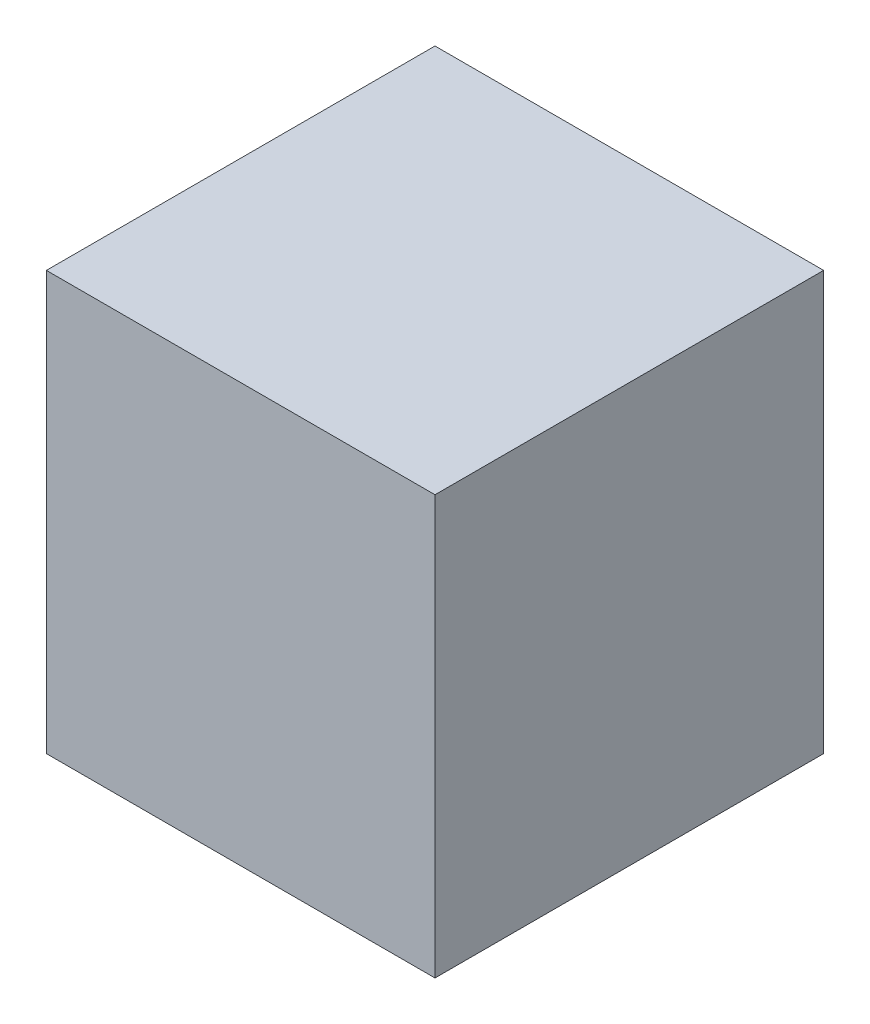
ISO-10303-21;
HEADER;
FILE_DESCRIPTION(('STEP AP214'),'2;1');
FILE_NAME('part.step','',(''),(''),'','','');
FILE_SCHEMA(('AUTOMOTIVE_DESIGN { 1 0 10303 214 1 1 1 1 }'));
ENDSEC;
DATA;
#1=APPLICATION_CONTEXT('core data for automotive mechanical design processes');
#2=APPLICATION_PROTOCOL_DEFINITION('international standard','automotive_design',2000,#1);
#3=PRODUCT_CONTEXT('',#1,'mechanical');
#4=PRODUCT('Part','Part','',(#3));
#5=PRODUCT_RELATED_PRODUCT_CATEGORY('part','',(#4));
#6=PRODUCT_DEFINITION_FORMATION('','',#4);
#7=PRODUCT_DEFINITION_CONTEXT('part definition',#1,'design');
#8=PRODUCT_DEFINITION('design','',#6,#7);
#9=PRODUCT_DEFINITION_SHAPE('','',#8);
#10=(LENGTH_UNIT() NAMED_UNIT(*) SI_UNIT(.MILLI.,.METRE.));
#11=(NAMED_UNIT(*) PLANE_ANGLE_UNIT() SI_UNIT($,.RADIAN.));
#12=(NAMED_UNIT(*) SI_UNIT($,.STERADIAN.) SOLID_ANGLE_UNIT());
#13=UNCERTAINTY_MEASURE_WITH_UNIT(LENGTH_MEASURE(1.E-05),#10,'distance_accuracy_value','');
#14=(GEOMETRIC_REPRESENTATION_CONTEXT(3) GLOBAL_UNCERTAINTY_ASSIGNED_CONTEXT((#13)) GLOBAL_UNIT_ASSIGNED_CONTEXT((#10,
#11,#12)) REPRESENTATION_CONTEXT('',''));
#15=CARTESIAN_POINT('',(0.,0.,0.));
#16=DIRECTION('',(0.,0.,1.));
#17=DIRECTION('',(1.,0.,0.));
#18=AXIS2_PLACEMENT_3D('',#15,#16,#17);
#19=CARTESIAN_POINT('',(0.,177.8,0.));
#20=DIRECTION('',(1.,0.,0.));
#21=DIRECTION('',(0.,0.,-1.));
#22=AXIS2_PLACEMENT_3D('',#19,#20,#21);
#23=PLANE('',#22);
#24=DIRECTION('',(0.,0.,1.));
#25=VECTOR('',#24,1.);
#26=CARTESIAN_POINT('',(0.,0.,0.));
#27=LINE('',#26,#25);
#28=CARTESIAN_POINT('',(0.,0.,0.));
#29=VERTEX_POINT('',#28);
#30=CARTESIAN_POINT('',(0.,0.,165.1));
#31=VERTEX_POINT('',#30);
#32=EDGE_CURVE('E95',#29,#31,#27,.T.);
#33=ORIENTED_EDGE('',*,*,#32,.T.);
#34=DIRECTION('',(0.,-1.,0.));
#35=VECTOR('',#34,1.);
#36=CARTESIAN_POINT('',(0.,177.8,165.1));
#37=LINE('',#36,#35);
#38=CARTESIAN_POINT('',(0.,177.8,165.1));
#39=VERTEX_POINT('',#38);
#40=EDGE_CURVE('E11',#39,#31,#37,.T.);
#41=ORIENTED_EDGE('',*,*,#40,.F.);
#42=DIRECTION('',(0.,0.,1.));
#43=VECTOR('',#42,1.);
#44=CARTESIAN_POINT('',(0.,177.8,0.));
#45=LINE('',#44,#43);
#46=CARTESIAN_POINT('',(0.,177.8,0.));
#47=VERTEX_POINT('',#46);
#48=EDGE_CURVE('E83',#47,#39,#45,.T.);
#49=ORIENTED_EDGE('',*,*,#48,.F.);
#50=DIRECTION('',(0.,-1.,0.));
#51=VECTOR('',#50,1.);
#52=CARTESIAN_POINT('',(0.,177.8,0.));
#53=LINE('',#52,#51);
#54=EDGE_CURVE('E91',#47,#29,#53,.T.);
#55=ORIENTED_EDGE('',*,*,#54,.T.);
#56=EDGE_LOOP('',(#33,#41,#49,#55));
#57=FACE_BOUND('',#56,.T.);
#58=ADVANCED_FACE('F32',(#57),#23,.F.);
#59=CARTESIAN_POINT('',(0.,177.8,165.1));
#60=DIRECTION('',(0.,0.,-1.));
#61=DIRECTION('',(-1.,0.,0.));
#62=AXIS2_PLACEMENT_3D('',#59,#60,#61);
#63=PLANE('',#62);
#64=DIRECTION('',(1.,0.,0.));
#65=VECTOR('',#64,1.);
#66=CARTESIAN_POINT('',(0.,0.,165.1));
#67=LINE('',#66,#65);
#68=CARTESIAN_POINT('',(165.1,0.,165.1));
#69=VERTEX_POINT('',#68);
#70=EDGE_CURVE('E87',#31,#69,#67,.T.);
#71=ORIENTED_EDGE('',*,*,#70,.T.);
#72=DIRECTION('',(0.,-1.,0.));
#73=VECTOR('',#72,1.);
#74=CARTESIAN_POINT('',(165.1,177.8,165.1));
#75=LINE('',#74,#73);
#76=CARTESIAN_POINT('',(165.1,177.8,165.1));
#77=VERTEX_POINT('',#76);
#78=EDGE_CURVE('E40',#77,#69,#75,.T.);
#79=ORIENTED_EDGE('',*,*,#78,.F.);
#80=DIRECTION('',(1.,0.,0.));
#81=VECTOR('',#80,1.);
#82=CARTESIAN_POINT('',(0.,177.8,165.1));
#83=LINE('',#82,#81);
#84=EDGE_CURVE('E78',#39,#77,#83,.T.);
#85=ORIENTED_EDGE('',*,*,#84,.F.);
#86=ORIENTED_EDGE('',*,*,#40,.T.);
#87=EDGE_LOOP('',(#71,#79,#85,#86));
#88=FACE_BOUND('',#87,.T.);
#89=ADVANCED_FACE('F86',(#88),#63,.F.);
#90=CARTESIAN_POINT('',(165.1,177.8,0.));
#91=DIRECTION('',(-1.,0.,0.));
#92=DIRECTION('',(0.,0.,1.));
#93=AXIS2_PLACEMENT_3D('',#90,#91,#92);
#94=PLANE('',#93);
#95=DIRECTION('',(0.,0.,-1.));
#96=VECTOR('',#95,1.);
#97=CARTESIAN_POINT('',(165.1,0.,0.));
#98=LINE('',#97,#96);
#99=CARTESIAN_POINT('',(165.1,0.,0.));
#100=VERTEX_POINT('',#99);
#101=EDGE_CURVE('E65',#69,#100,#98,.T.);
#102=ORIENTED_EDGE('',*,*,#101,.T.);
#103=DIRECTION('',(0.,-1.,0.));
#104=VECTOR('',#103,1.);
#105=CARTESIAN_POINT('',(165.1,177.8,0.));
#106=LINE('',#105,#104);
#107=CARTESIAN_POINT('',(165.1,177.8,0.));
#108=VERTEX_POINT('',#107);
#109=EDGE_CURVE('E88',#108,#100,#106,.T.);
#110=ORIENTED_EDGE('',*,*,#109,.F.);
#111=DIRECTION('',(0.,0.,-1.));
#112=VECTOR('',#111,1.);
#113=CARTESIAN_POINT('',(165.1,177.8,0.));
#114=LINE('',#113,#112);
#115=EDGE_CURVE('E81',#77,#108,#114,.T.);
#116=ORIENTED_EDGE('',*,*,#115,.F.);
#117=ORIENTED_EDGE('',*,*,#78,.T.);
#118=EDGE_LOOP('',(#102,#110,#116,#117));
#119=FACE_BOUND('',#118,.T.);
#120=ADVANCED_FACE('F89',(#119),#94,.F.);
#121=CARTESIAN_POINT('',(0.,177.8,0.));
#122=DIRECTION('',(0.,0.,1.));
#123=DIRECTION('',(1.,0.,0.));
#124=AXIS2_PLACEMENT_3D('',#121,#122,#123);
#125=PLANE('',#124);
#126=DIRECTION('',(-1.,0.,0.));
#127=VECTOR('',#126,1.);
#128=CARTESIAN_POINT('',(0.,0.,0.));
#129=LINE('',#128,#127);
#130=EDGE_CURVE('E71',#100,#29,#129,.T.);
#131=ORIENTED_EDGE('',*,*,#130,.T.);
#132=ORIENTED_EDGE('',*,*,#54,.F.);
#133=DIRECTION('',(-1.,0.,0.));
#134=VECTOR('',#133,1.);
#135=CARTESIAN_POINT('',(0.,177.8,0.));
#136=LINE('',#135,#134);
#137=EDGE_CURVE('E48',#108,#47,#136,.T.);
#138=ORIENTED_EDGE('',*,*,#137,.F.);
#139=ORIENTED_EDGE('',*,*,#109,.T.);
#140=EDGE_LOOP('',(#131,#132,#138,#139));
#141=FACE_BOUND('',#140,.T.);
#142=ADVANCED_FACE('F102',(#141),#125,.F.);
#143=CARTESIAN_POINT('',(0.,177.8,0.));
#144=DIRECTION('',(0.,1.,0.));
#145=DIRECTION('',(0.,0.,1.));
#146=AXIS2_PLACEMENT_3D('',#143,#144,#145);
#147=PLANE('',#146);
#148=ORIENTED_EDGE('',*,*,#48,.T.);
#149=ORIENTED_EDGE('',*,*,#84,.T.);
#150=ORIENTED_EDGE('',*,*,#115,.T.);
#151=ORIENTED_EDGE('',*,*,#137,.T.);
#152=EDGE_LOOP('',(#148,#149,#150,#151));
#153=FACE_BOUND('',#152,.T.);
#154=ADVANCED_FACE('F79',(#153),#147,.T.);
#155=CARTESIAN_POINT('',(0.,0.,0.));
#156=DIRECTION('',(0.,1.,0.));
#157=DIRECTION('',(0.,0.,1.));
#158=AXIS2_PLACEMENT_3D('',#155,#156,#157);
#159=PLANE('',#158);
#160=ORIENTED_EDGE('',*,*,#32,.F.);
#161=ORIENTED_EDGE('',*,*,#130,.F.);
#162=ORIENTED_EDGE('',*,*,#101,.F.);
#163=ORIENTED_EDGE('',*,*,#70,.F.);
#164=EDGE_LOOP('',(#160,#161,#162,#163));
#165=FACE_BOUND('',#164,.T.);
#166=ADVANCED_FACE('F105',(#165),#159,.F.);
#167=CLOSED_SHELL('',(#58,#89,#120,#142,#154,#166));
#168=MANIFOLD_SOLID_BREP('B2',#167);
#169=ADVANCED_BREP_SHAPE_REPRESENTATION('',(#18,#168),#14);
#170=SHAPE_DEFINITION_REPRESENTATION(#9,#169);
ENDSEC;
END-ISO-10303-21;
